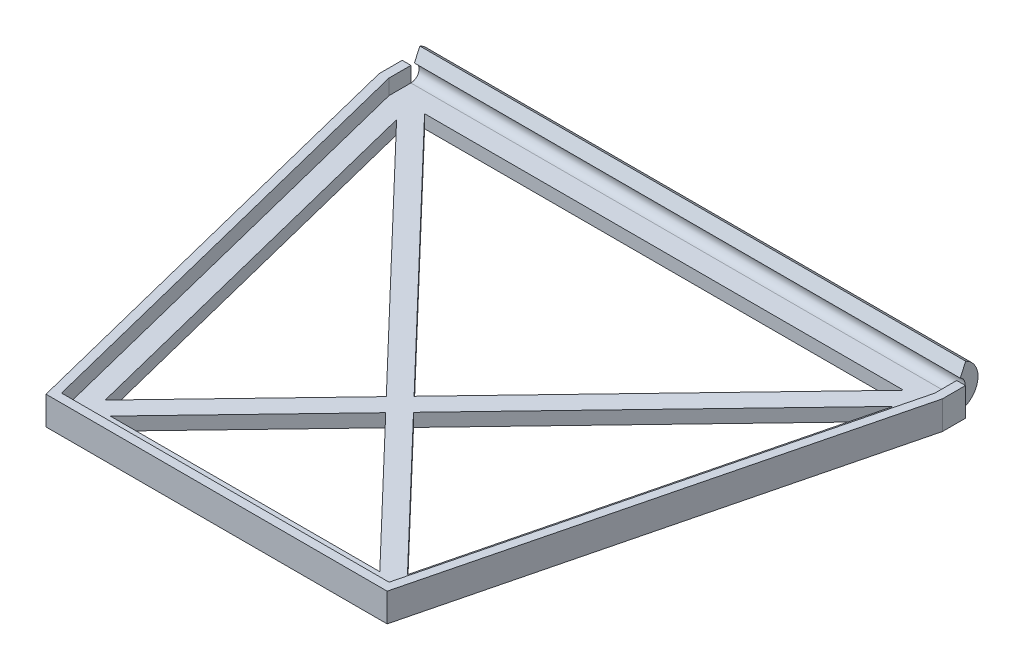
ISO-10303-21;
HEADER;
FILE_DESCRIPTION(('STEP AP214'),'2;1');
FILE_NAME('part.step','',(''),(''),'','','');
FILE_SCHEMA(('AUTOMOTIVE_DESIGN { 1 0 10303 214 1 1 1 1 }'));
ENDSEC;
DATA;
#1=APPLICATION_CONTEXT('core data for automotive mechanical design processes');
#2=APPLICATION_PROTOCOL_DEFINITION('international standard','automotive_design',2000,#1);
#3=PRODUCT_CONTEXT('',#1,'mechanical');
#4=PRODUCT('Part','Part','',(#3));
#5=PRODUCT_RELATED_PRODUCT_CATEGORY('part','',(#4));
#6=PRODUCT_DEFINITION_FORMATION('','',#4);
#7=PRODUCT_DEFINITION_CONTEXT('part definition',#1,'design');
#8=PRODUCT_DEFINITION('design','',#6,#7);
#9=PRODUCT_DEFINITION_SHAPE('','',#8);
#10=(LENGTH_UNIT() NAMED_UNIT(*) SI_UNIT(.MILLI.,.METRE.));
#11=(NAMED_UNIT(*) PLANE_ANGLE_UNIT() SI_UNIT($,.RADIAN.));
#12=(NAMED_UNIT(*) SI_UNIT($,.STERADIAN.) SOLID_ANGLE_UNIT());
#13=UNCERTAINTY_MEASURE_WITH_UNIT(LENGTH_MEASURE(1.E-05),#10,'distance_accuracy_value','');
#14=(GEOMETRIC_REPRESENTATION_CONTEXT(3) GLOBAL_UNCERTAINTY_ASSIGNED_CONTEXT((#13)) GLOBAL_UNIT_ASSIGNED_CONTEXT((#10,
#11,#12)) REPRESENTATION_CONTEXT('',''));
#15=CARTESIAN_POINT('',(0.,0.,0.));
#16=DIRECTION('',(0.,0.,1.));
#17=DIRECTION('',(1.,0.,0.));
#18=AXIS2_PLACEMENT_3D('',#15,#16,#17);
#19=CARTESIAN_POINT('',(25.01,1.2,-40.));
#20=DIRECTION('',(-1.,0.,0.));
#21=DIRECTION('',(0.,0.,1.));
#22=AXIS2_PLACEMENT_3D('',#19,#20,#21);
#23=PLANE('',#22);
#24=DIRECTION('',(0.,-1.,0.));
#25=VECTOR('',#24,1.);
#26=CARTESIAN_POINT('',(25.01,71.0684486178114,-42.01));
#27=LINE('',#26,#25);
#28=CARTESIAN_POINT('',(25.01,1.2,-42.01));
#29=VERTEX_POINT('',#28);
#30=CARTESIAN_POINT('',(25.01,0.,-42.01));
#31=VERTEX_POINT('',#30);
#32=EDGE_CURVE('E359',#29,#31,#27,.T.);
#33=ORIENTED_EDGE('',*,*,#32,.T.);
#34=CARTESIAN_POINT('',(25.01,1.95,-42.01));
#35=DIRECTION('',(-1.,0.,0.));
#36=DIRECTION('',(0.,0.,1.));
#37=AXIS2_PLACEMENT_3D('',#34,#35,#36);
#38=CIRCLE('',#37,1.95);
#39=CARTESIAN_POINT('',(25.01,3.71730018472147,-42.8341056103944));
#40=VERTEX_POINT('',#39);
#41=EDGE_CURVE('E376',#31,#40,#38,.F.);
#42=ORIENTED_EDGE('',*,*,#41,.T.);
#43=DIRECTION('',(0.,-0.906307787036654,0.42261826174069));
#44=VECTOR('',#43,1.);
#45=CARTESIAN_POINT('',(25.01,2.62973084027748,-42.3269636963055));
#46=LINE('',#45,#44);
#47=CARTESIAN_POINT('',(25.01,2.62973084027749,-42.3269636963055));
#48=VERTEX_POINT('',#47);
#49=EDGE_CURVE('E383',#40,#48,#46,.T.);
#50=ORIENTED_EDGE('',*,*,#49,.T.);
#51=CARTESIAN_POINT('',(25.01,1.95,-42.01));
#52=DIRECTION('',(-1.,0.,0.));
#53=DIRECTION('',(0.,0.,1.));
#54=AXIS2_PLACEMENT_3D('',#51,#52,#53);
#55=CIRCLE('',#54,0.75);
#56=EDGE_CURVE('E379',#48,#29,#55,.T.);
#57=ORIENTED_EDGE('',*,*,#56,.T.);
#58=EDGE_LOOP('',(#33,#42,#50,#57));
#59=FACE_BOUND('',#58,.T.);
#60=ADVANCED_FACE('F95',(#59),#23,.F.);
#61=CARTESIAN_POINT('',(-25.01,1.2,-42.));
#62=DIRECTION('',(1.,0.,0.));
#63=DIRECTION('',(0.,0.,-1.));
#64=AXIS2_PLACEMENT_3D('',#61,#62,#63);
#65=PLANE('',#64);
#66=DIRECTION('',(0.,-1.,0.));
#67=VECTOR('',#66,1.);
#68=CARTESIAN_POINT('',(-25.01,71.0684486178114,-42.01));
#69=LINE('',#68,#67);
#70=CARTESIAN_POINT('',(-25.01,1.2,-42.01));
#71=VERTEX_POINT('',#70);
#72=CARTESIAN_POINT('',(-25.01,0.,-42.01));
#73=VERTEX_POINT('',#72);
#74=EDGE_CURVE('E282',#71,#73,#69,.T.);
#75=ORIENTED_EDGE('',*,*,#74,.F.);
#76=CARTESIAN_POINT('',(-25.01,1.95,-42.01));
#77=DIRECTION('',(1.,0.,0.));
#78=DIRECTION('',(0.,0.,-1.));
#79=AXIS2_PLACEMENT_3D('',#76,#77,#78);
#80=CIRCLE('',#79,0.75);
#81=CARTESIAN_POINT('',(-25.01,2.62973084027749,-42.3269636963055));
#82=VERTEX_POINT('',#81);
#83=EDGE_CURVE('E293',#71,#82,#80,.T.);
#84=ORIENTED_EDGE('',*,*,#83,.T.);
#85=DIRECTION('',(0.,0.906307787036654,-0.42261826174069));
#86=VECTOR('',#85,1.);
#87=CARTESIAN_POINT('',(-25.01,2.62973084027749,-42.3269636963055));
#88=LINE('',#87,#86);
#89=CARTESIAN_POINT('',(-25.01,3.71730018472147,-42.8341056103944));
#90=VERTEX_POINT('',#89);
#91=EDGE_CURVE('E387',#82,#90,#88,.T.);
#92=ORIENTED_EDGE('',*,*,#91,.T.);
#93=CARTESIAN_POINT('',(-25.01,1.95,-42.01));
#94=DIRECTION('',(-1.,0.,0.));
#95=DIRECTION('',(0.,0.,-1.));
#96=AXIS2_PLACEMENT_3D('',#93,#94,#95);
#97=CIRCLE('',#96,1.95);
#98=EDGE_CURVE('E391',#90,#73,#97,.T.);
#99=ORIENTED_EDGE('',*,*,#98,.T.);
#100=EDGE_LOOP('',(#75,#84,#92,#99));
#101=FACE_BOUND('',#100,.T.);
#102=ADVANCED_FACE('F596',(#101),#65,.F.);
#103=CARTESIAN_POINT('',(-23.2537434997384,1.2,-40.4365641250654));
#104=DIRECTION('',(0.970142500145332,0.,-0.242535625036333));
#105=DIRECTION('',(-0.242535625036333,0.,-0.970142500145332));
#106=AXIS2_PLACEMENT_3D('',#103,#104,#105);
#107=PLANE('',#106);
#108=DIRECTION('',(0.242535625036333,0.,0.970142500145332));
#109=VECTOR('',#108,1.);
#110=CARTESIAN_POINT('',(-23.2537434997384,1.2,-40.4365641250654));
#111=LINE('',#110,#109);
#112=CARTESIAN_POINT('',(-22.7545280310404,1.2,-38.4397022502735));
#113=VERTEX_POINT('',#112);
#114=CARTESIAN_POINT('',(-13.8525347629165,1.2,-2.83172917777767));
#115=VERTEX_POINT('',#114);
#116=EDGE_CURVE('E109',#113,#115,#111,.T.);
#117=ORIENTED_EDGE('',*,*,#116,.T.);
#118=DIRECTION('',(0.,-1.,0.));
#119=VECTOR('',#118,1.);
#120=CARTESIAN_POINT('',(-13.8525347629165,1.2,-2.83172917777769));
#121=LINE('',#120,#119);
#122=CARTESIAN_POINT('',(-13.8525347629165,0.,-2.83172917777767));
#123=VERTEX_POINT('',#122);
#124=EDGE_CURVE('E13',#115,#123,#121,.T.);
#125=ORIENTED_EDGE('',*,*,#124,.T.);
#126=DIRECTION('',(0.242535625036333,0.,0.970142500145332));
#127=VECTOR('',#126,1.);
#128=CARTESIAN_POINT('',(-23.2537434997384,0.,-40.4365641250654));
#129=LINE('',#128,#127);
#130=CARTESIAN_POINT('',(-22.7545280310404,0.,-38.4397022502735));
#131=VERTEX_POINT('',#130);
#132=EDGE_CURVE('E448',#131,#123,#129,.T.);
#133=ORIENTED_EDGE('',*,*,#132,.F.);
#134=DIRECTION('',(0.,1.,0.));
#135=VECTOR('',#134,1.);
#136=CARTESIAN_POINT('',(-22.7545280310404,1.2,-38.4397022502735));
#137=LINE('',#136,#135);
#138=EDGE_CURVE('E103',#131,#113,#137,.T.);
#139=ORIENTED_EDGE('',*,*,#138,.T.);
#140=EDGE_LOOP('',(#117,#125,#133,#139));
#141=FACE_BOUND('',#140,.T.);
#142=ADVANCED_FACE('F601',(#141),#107,.T.);
#143=CARTESIAN_POINT('',(-15.,1.2,-1.8));
#144=DIRECTION('',(0.,0.,-1.));
#145=DIRECTION('',(-1.,0.,0.));
#146=AXIS2_PLACEMENT_3D('',#143,#144,#145);
#147=PLANE('',#146);
#148=DIRECTION('',(0.,-1.,0.));
#149=VECTOR('',#148,1.);
#150=CARTESIAN_POINT('',(-12.3482197531764,1.2,-1.8));
#151=LINE('',#150,#149);
#152=CARTESIAN_POINT('',(-12.3482197531764,1.2,-1.8));
#153=VERTEX_POINT('',#152);
#154=CARTESIAN_POINT('',(-12.3482197531764,0.,-1.8));
#155=VERTEX_POINT('',#154);
#156=EDGE_CURVE('E520',#153,#155,#151,.T.);
#157=ORIENTED_EDGE('',*,*,#156,.F.);
#158=DIRECTION('',(1.,0.,0.));
#159=VECTOR('',#158,1.);
#160=CARTESIAN_POINT('',(-15.,1.2,-1.8));
#161=LINE('',#160,#159);
#162=CARTESIAN_POINT('',(12.3482197531764,1.2,-1.8));
#163=VERTEX_POINT('',#162);
#164=EDGE_CURVE('E454',#153,#163,#161,.T.);
#165=ORIENTED_EDGE('',*,*,#164,.T.);
#166=DIRECTION('',(0.,-1.,0.));
#167=VECTOR('',#166,1.);
#168=CARTESIAN_POINT('',(12.3482197531764,1.2,-1.8));
#169=LINE('',#168,#167);
#170=CARTESIAN_POINT('',(12.3482197531764,0.,-1.8));
#171=VERTEX_POINT('',#170);
#172=EDGE_CURVE('E517',#163,#171,#169,.T.);
#173=ORIENTED_EDGE('',*,*,#172,.T.);
#174=DIRECTION('',(1.,0.,0.));
#175=VECTOR('',#174,1.);
#176=CARTESIAN_POINT('',(-15.,0.,-1.8));
#177=LINE('',#176,#175);
#178=EDGE_CURVE('E468',#155,#171,#177,.T.);
#179=ORIENTED_EDGE('',*,*,#178,.F.);
#180=EDGE_LOOP('',(#157,#165,#173,#179));
#181=FACE_BOUND('',#180,.T.);
#182=ADVANCED_FACE('F705',(#181),#147,.T.);
#183=CARTESIAN_POINT('',(25.,1.2,-40.2));
#184=DIRECTION('',(0.,0.,1.));
#185=DIRECTION('',(1.,0.,0.));
#186=AXIS2_PLACEMENT_3D('',#183,#184,#185);
#187=PLANE('',#186);
#188=DIRECTION('',(-1.,0.,0.));
#189=VECTOR('',#188,1.);
#190=CARTESIAN_POINT('',(25.,0.,-40.2));
#191=LINE('',#190,#189);
#192=CARTESIAN_POINT('',(21.9482197531764,0.,-40.2));
#193=VERTEX_POINT('',#192);
#194=CARTESIAN_POINT('',(-21.9482197531764,0.,-40.2));
#195=VERTEX_POINT('',#194);
#196=EDGE_CURVE('E455',#193,#195,#191,.T.);
#197=ORIENTED_EDGE('',*,*,#196,.F.);
#198=DIRECTION('',(0.,1.,0.));
#199=VECTOR('',#198,1.);
#200=CARTESIAN_POINT('',(21.9482197531764,1.2,-40.2));
#201=LINE('',#200,#199);
#202=CARTESIAN_POINT('',(21.9482197531764,1.2,-40.2));
#203=VERTEX_POINT('',#202);
#204=EDGE_CURVE('E505',#193,#203,#201,.T.);
#205=ORIENTED_EDGE('',*,*,#204,.T.);
#206=DIRECTION('',(-1.,0.,0.));
#207=VECTOR('',#206,1.);
#208=CARTESIAN_POINT('',(25.,1.2,-40.2));
#209=LINE('',#208,#207);
#210=CARTESIAN_POINT('',(-21.9482197531764,1.2,-40.2));
#211=VERTEX_POINT('',#210);
#212=EDGE_CURVE('E461',#203,#211,#209,.T.);
#213=ORIENTED_EDGE('',*,*,#212,.T.);
#214=DIRECTION('',(0.,1.,0.));
#215=VECTOR('',#214,1.);
#216=CARTESIAN_POINT('',(-21.9482197531764,1.2,-40.2));
#217=LINE('',#216,#215);
#218=EDGE_CURVE('E498',#195,#211,#217,.T.);
#219=ORIENTED_EDGE('',*,*,#218,.F.);
#220=EDGE_LOOP('',(#197,#205,#213,#219));
#221=FACE_BOUND('',#220,.T.);
#222=ADVANCED_FACE('F569',(#221),#187,.T.);
#223=CARTESIAN_POINT('',(0.,1.2,0.));
#224=DIRECTION('',(0.,1.,0.));
#225=DIRECTION('',(0.,0.,1.));
#226=AXIS2_PLACEMENT_3D('',#223,#224,#225);
#227=PLANE('',#226);
#228=ORIENTED_EDGE('',*,*,#164,.F.);
#229=DIRECTION('',(-0.69179954128703,0.,0.722089602940698));
#230=VECTOR('',#229,1.);
#231=CARTESIAN_POINT('',(23.8444831111187,1.2,-39.5773804128417));
#232=LINE('',#231,#230);
#233=CARTESIAN_POINT('',(0.,1.2,-14.6888797497715));
#234=VERTEX_POINT('',#233);
#235=EDGE_CURVE('E435',#234,#153,#232,.T.);
#236=ORIENTED_EDGE('',*,*,#235,.F.);
#237=DIRECTION('',(0.69179954128703,0.,0.722089602940698));
#238=VECTOR('',#237,1.);
#239=CARTESIAN_POINT('',(-23.8444831111187,1.2,-39.5773804128417));
#240=LINE('',#239,#238);
#241=EDGE_CURVE('E411',#234,#163,#240,.T.);
#242=ORIENTED_EDGE('',*,*,#241,.T.);
#243=EDGE_LOOP('',(#228,#236,#242));
#244=FACE_BOUND('',#243,.T.);
#245=DIRECTION('',(-0.69179954128703,0.,0.722089602940698));
#246=VECTOR('',#245,1.);
#247=CARTESIAN_POINT('',(22.5447218258254,1.2,-40.8226195871583));
#248=LINE('',#247,#246);
#249=CARTESIAN_POINT('',(-1.24638271529567,1.2,-15.9898346453553));
#250=VERTEX_POINT('',#249);
#251=EDGE_CURVE('E444',#250,#115,#248,.T.);
#252=ORIENTED_EDGE('',*,*,#251,.T.);
#253=ORIENTED_EDGE('',*,*,#116,.F.);
#254=EDGE_CURVE('E412',#113,#250,#240,.T.);
#255=ORIENTED_EDGE('',*,*,#254,.T.);
#256=EDGE_LOOP('',(#252,#253,#255));
#257=FACE_BOUND('',#256,.T.);
#258=CARTESIAN_POINT('',(22.7545280310405,1.2,-38.4397022502736));
#259=VERTEX_POINT('',#258);
#260=CARTESIAN_POINT('',(1.24638271529567,1.2,-15.9898346453553));
#261=VERTEX_POINT('',#260);
#262=EDGE_CURVE('E449',#259,#261,#232,.T.);
#263=ORIENTED_EDGE('',*,*,#262,.F.);
#264=DIRECTION('',(0.242535625036333,0.,-0.970142500145332));
#265=VECTOR('',#264,1.);
#266=CARTESIAN_POINT('',(13.2537434997384,1.2,-0.436564125065405));
#267=LINE('',#266,#265);
#268=CARTESIAN_POINT('',(13.8525347629165,1.2,-2.83172917777768));
#269=VERTEX_POINT('',#268);
#270=EDGE_CURVE('E458',#269,#259,#267,.T.);
#271=ORIENTED_EDGE('',*,*,#270,.F.);
#272=DIRECTION('',(0.69179954128703,0.,0.722089602940698));
#273=VECTOR('',#272,1.);
#274=CARTESIAN_POINT('',(-22.5447218258254,1.2,-40.8226195871583));
#275=LINE('',#274,#273);
#276=EDGE_CURVE('E401',#261,#269,#275,.T.);
#277=ORIENTED_EDGE('',*,*,#276,.F.);
#278=EDGE_LOOP('',(#263,#271,#277));
#279=FACE_BOUND('',#278,.T.);
#280=ORIENTED_EDGE('',*,*,#212,.F.);
#281=CARTESIAN_POINT('',(0.,1.2,-17.2907895409391));
#282=VERTEX_POINT('',#281);
#283=EDGE_CURVE('E445',#203,#282,#248,.T.);
#284=ORIENTED_EDGE('',*,*,#283,.T.);
#285=EDGE_CURVE('E416',#211,#282,#275,.T.);
#286=ORIENTED_EDGE('',*,*,#285,.F.);
#287=EDGE_LOOP('',(#280,#284,#286));
#288=FACE_BOUND('',#287,.T.);
#289=DIRECTION('',(0.242535625036333,0.,0.970142500145332));
#290=VECTOR('',#289,1.);
#291=CARTESIAN_POINT('',(-25.0097014250015,1.2,-39.9975746437496));
#292=LINE('',#291,#290);
#293=CARTESIAN_POINT('',(-25.01,1.2,-39.9987689437438));
#294=VERTEX_POINT('',#293);
#295=CARTESIAN_POINT('',(-15.007807764064,1.2,0.01));
#296=VERTEX_POINT('',#295);
#297=EDGE_CURVE('E479',#294,#296,#292,.T.);
#298=ORIENTED_EDGE('',*,*,#297,.T.);
#299=DIRECTION('',(1.,0.,0.));
#300=VECTOR('',#299,1.);
#301=CARTESIAN_POINT('',(-15.,1.2,0.01));
#302=LINE('',#301,#300);
#303=CARTESIAN_POINT('',(15.007807764064,1.2,0.00999999999999463));
#304=VERTEX_POINT('',#303);
#305=EDGE_CURVE('E482',#296,#304,#302,.T.);
#306=ORIENTED_EDGE('',*,*,#305,.T.);
#307=DIRECTION('',(0.242535625036333,0.,-0.970142500145332));
#308=VECTOR('',#307,1.);
#309=CARTESIAN_POINT('',(15.0097014250015,1.2,0.00242535625035796));
#310=LINE('',#309,#308);
#311=CARTESIAN_POINT('',(25.01,1.2,-39.9987689437438));
#312=VERTEX_POINT('',#311);
#313=EDGE_CURVE('E485',#304,#312,#310,.T.);
#314=ORIENTED_EDGE('',*,*,#313,.T.);
#315=DIRECTION('',(0.,0.,-1.));
#316=VECTOR('',#315,1.);
#317=CARTESIAN_POINT('',(25.01,1.2,-40.));
#318=LINE('',#317,#316);
#319=EDGE_CURVE('E488',#312,#29,#318,.T.);
#320=ORIENTED_EDGE('',*,*,#319,.T.);
#321=DIRECTION('',(-1.,0.,0.));
#322=VECTOR('',#321,1.);
#323=CARTESIAN_POINT('',(25.,1.2,-42.01));
#324=LINE('',#323,#322);
#325=EDGE_CURVE('E492',#29,#71,#324,.T.);
#326=ORIENTED_EDGE('',*,*,#325,.T.);
#327=DIRECTION('',(0.,0.,1.));
#328=VECTOR('',#327,1.);
#329=CARTESIAN_POINT('',(-25.01,1.2,-42.));
#330=LINE('',#329,#328);
#331=EDGE_CURVE('E277',#71,#294,#330,.T.);
#332=ORIENTED_EDGE('',*,*,#331,.T.);
#333=EDGE_LOOP('',(#298,#306,#314,#320,#326,#332));
#334=FACE_BOUND('',#333,.T.);
#335=ADVANCED_FACE('F548',(#244,#257,#279,#288,#334),#227,.T.);
#336=CARTESIAN_POINT('',(0.,0.,0.));
#337=DIRECTION('',(0.,1.,0.));
#338=DIRECTION('',(0.,0.,1.));
#339=AXIS2_PLACEMENT_3D('',#336,#337,#338);
#340=PLANE('',#339);
#341=DIRECTION('',(-1.,0.,0.));
#342=VECTOR('',#341,1.);
#343=CARTESIAN_POINT('',(25.,0.,-42.01));
#344=LINE('',#343,#342);
#345=EDGE_CURVE('E464',#31,#73,#344,.T.);
#346=ORIENTED_EDGE('',*,*,#345,.F.);
#347=DIRECTION('',(-1.,0.,0.));
#348=VECTOR('',#347,1.);
#349=CARTESIAN_POINT('',(25.81,0.,-42.01));
#350=LINE('',#349,#348);
#351=CARTESIAN_POINT('',(25.81,0.,-42.01));
#352=VERTEX_POINT('',#351);
#353=EDGE_CURVE('E353',#352,#31,#350,.T.);
#354=ORIENTED_EDGE('',*,*,#353,.F.);
#355=DIRECTION('',(0.,0.,1.));
#356=VECTOR('',#355,1.);
#357=CARTESIAN_POINT('',(25.81,0.,-42.01));
#358=LINE('',#357,#356);
#359=CARTESIAN_POINT('',(25.81,0.,-39.9002844432497));
#360=VERTEX_POINT('',#359);
#361=EDGE_CURVE('E628',#352,#360,#358,.T.);
#362=ORIENTED_EDGE('',*,*,#361,.T.);
#363=DIRECTION('',(-0.242535625036333,0.,0.970142500145332));
#364=VECTOR('',#363,1.);
#365=CARTESIAN_POINT('',(25.7861140001163,0.,-39.8047404437148));
#366=LINE('',#365,#364);
#367=CARTESIAN_POINT('',(15.6324288891876,0.,0.809999999999993));
#368=VERTEX_POINT('',#367);
#369=EDGE_CURVE('E635',#360,#368,#366,.T.);
#370=ORIENTED_EDGE('',*,*,#369,.T.);
#371=DIRECTION('',(-1.,0.,0.));
#372=VECTOR('',#371,1.);
#373=CARTESIAN_POINT('',(15.007807764064,0.,0.809999999999995));
#374=LINE('',#373,#372);
#375=CARTESIAN_POINT('',(-15.6324288891876,0.,0.809999999999999));
#376=VERTEX_POINT('',#375);
#377=EDGE_CURVE('E638',#368,#376,#374,.T.);
#378=ORIENTED_EDGE('',*,*,#377,.T.);
#379=DIRECTION('',(-0.242535625036333,0.,-0.970142500145332));
#380=VECTOR('',#379,1.);
#381=CARTESIAN_POINT('',(-15.7839217641803,0.,0.204028500029067));
#382=LINE('',#381,#380);
#383=CARTESIAN_POINT('',(-25.81,0.,-39.9002844432497));
#384=VERTEX_POINT('',#383);
#385=EDGE_CURVE('E322',#376,#384,#382,.T.);
#386=ORIENTED_EDGE('',*,*,#385,.T.);
#387=DIRECTION('',(0.,0.,1.));
#388=VECTOR('',#387,1.);
#389=CARTESIAN_POINT('',(-25.81,0.,-39.9987689437438));
#390=LINE('',#389,#388);
#391=CARTESIAN_POINT('',(-25.81,0.,-42.01));
#392=VERTEX_POINT('',#391);
#393=EDGE_CURVE('E305',#384,#392,#390,.F.);
#394=ORIENTED_EDGE('',*,*,#393,.T.);
#395=DIRECTION('',(-1.,0.,0.));
#396=VECTOR('',#395,1.);
#397=CARTESIAN_POINT('',(-25.01,0.,-42.01));
#398=LINE('',#397,#396);
#399=EDGE_CURVE('E281',#73,#392,#398,.T.);
#400=ORIENTED_EDGE('',*,*,#399,.F.);
#401=EDGE_LOOP('',(#346,#354,#362,#370,#378,#386,#394,#400));
#402=FACE_BOUND('',#401,.T.);
#403=DIRECTION('',(-0.69179954128703,0.,0.722089602940698));
#404=VECTOR('',#403,1.);
#405=CARTESIAN_POINT('',(23.8444831111187,0.,-39.5773804128417));
#406=LINE('',#405,#404);
#407=CARTESIAN_POINT('',(0.,0.,-14.6888797497715));
#408=VERTEX_POINT('',#407);
#409=EDGE_CURVE('E439',#408,#155,#406,.T.);
#410=ORIENTED_EDGE('',*,*,#409,.T.);
#411=ORIENTED_EDGE('',*,*,#178,.T.);
#412=DIRECTION('',(0.69179954128703,0.,0.722089602940698));
#413=VECTOR('',#412,1.);
#414=CARTESIAN_POINT('',(-23.8444831111187,0.,-39.5773804128417));
#415=LINE('',#414,#413);
#416=EDGE_CURVE('E406',#408,#171,#415,.T.);
#417=ORIENTED_EDGE('',*,*,#416,.F.);
#418=EDGE_LOOP('',(#410,#411,#417));
#419=FACE_BOUND('',#418,.T.);
#420=ORIENTED_EDGE('',*,*,#132,.T.);
#421=DIRECTION('',(-0.69179954128703,0.,0.722089602940698));
#422=VECTOR('',#421,1.);
#423=CARTESIAN_POINT('',(22.5447218258254,0.,-40.8226195871583));
#424=LINE('',#423,#422);
#425=CARTESIAN_POINT('',(-1.24638271529567,0.,-15.9898346453553));
#426=VERTEX_POINT('',#425);
#427=EDGE_CURVE('E440',#426,#123,#424,.T.);
#428=ORIENTED_EDGE('',*,*,#427,.F.);
#429=EDGE_CURVE('E402',#131,#426,#415,.T.);
#430=ORIENTED_EDGE('',*,*,#429,.F.);
#431=EDGE_LOOP('',(#420,#428,#430));
#432=FACE_BOUND('',#431,.T.);
#433=DIRECTION('',(0.242535625036333,0.,-0.970142500145332));
#434=VECTOR('',#433,1.);
#435=CARTESIAN_POINT('',(13.2537434997384,0.,-0.436564125065405));
#436=LINE('',#435,#434);
#437=CARTESIAN_POINT('',(13.8525347629165,0.,-2.83172917777767));
#438=VERTEX_POINT('',#437);
#439=CARTESIAN_POINT('',(22.7545280310405,0.,-38.4397022502736));
#440=VERTEX_POINT('',#439);
#441=EDGE_CURVE('E472',#438,#440,#436,.T.);
#442=ORIENTED_EDGE('',*,*,#441,.T.);
#443=CARTESIAN_POINT('',(1.24638271529567,0.,-15.9898346453553));
#444=VERTEX_POINT('',#443);
#445=EDGE_CURVE('E441',#440,#444,#406,.T.);
#446=ORIENTED_EDGE('',*,*,#445,.T.);
#447=DIRECTION('',(0.69179954128703,0.,0.722089602940698));
#448=VECTOR('',#447,1.);
#449=CARTESIAN_POINT('',(-22.5447218258254,0.,-40.8226195871583));
#450=LINE('',#449,#448);
#451=EDGE_CURVE('E405',#444,#438,#450,.T.);
#452=ORIENTED_EDGE('',*,*,#451,.T.);
#453=EDGE_LOOP('',(#442,#446,#452));
#454=FACE_BOUND('',#453,.T.);
#455=CARTESIAN_POINT('',(0.,0.,-17.2907895409391));
#456=VERTEX_POINT('',#455);
#457=EDGE_CURVE('E436',#193,#456,#424,.T.);
#458=ORIENTED_EDGE('',*,*,#457,.F.);
#459=ORIENTED_EDGE('',*,*,#196,.T.);
#460=EDGE_CURVE('E407',#195,#456,#450,.T.);
#461=ORIENTED_EDGE('',*,*,#460,.T.);
#462=EDGE_LOOP('',(#458,#459,#461));
#463=FACE_BOUND('',#462,.T.);
#464=ADVANCED_FACE('F556',(#402,#419,#432,#454,#463),#340,.F.);
#465=CARTESIAN_POINT('',(13.2537434997384,1.2,-0.436564125065405));
#466=DIRECTION('',(-0.970142500145332,0.,-0.242535625036333));
#467=DIRECTION('',(-0.242535625036333,0.,0.970142500145332));
#468=AXIS2_PLACEMENT_3D('',#465,#466,#467);
#469=PLANE('',#468);
#470=DIRECTION('',(0.,1.,0.));
#471=VECTOR('',#470,1.);
#472=CARTESIAN_POINT('',(22.7545280310404,1.2,-38.4397022502736));
#473=LINE('',#472,#471);
#474=EDGE_CURVE('E513',#440,#259,#473,.T.);
#475=ORIENTED_EDGE('',*,*,#474,.F.);
#476=ORIENTED_EDGE('',*,*,#441,.F.);
#477=DIRECTION('',(0.,-1.,0.));
#478=VECTOR('',#477,1.);
#479=CARTESIAN_POINT('',(13.8525347629165,1.2,-2.83172917777767));
#480=LINE('',#479,#478);
#481=EDGE_CURVE('E509',#269,#438,#480,.T.);
#482=ORIENTED_EDGE('',*,*,#481,.F.);
#483=ORIENTED_EDGE('',*,*,#270,.T.);
#484=EDGE_LOOP('',(#475,#476,#482,#483));
#485=FACE_BOUND('',#484,.T.);
#486=ADVANCED_FACE('F551',(#485),#469,.T.);
#487=CARTESIAN_POINT('',(23.8444831111187,56.1773984203283,-39.5773804128417));
#488=DIRECTION('',(0.722089602940698,0.,0.69179954128703));
#489=DIRECTION('',(0.69179954128703,0.,-0.722089602940698));
#490=AXIS2_PLACEMENT_3D('',#487,#488,#489);
#491=PLANE('',#490);
#492=ORIENTED_EDGE('',*,*,#235,.T.);
#493=ORIENTED_EDGE('',*,*,#156,.T.);
#494=ORIENTED_EDGE('',*,*,#409,.F.);
#495=DIRECTION('',(0.,1.,0.));
#496=VECTOR('',#495,1.);
#497=CARTESIAN_POINT('',(0.,56.1773984203283,-14.6888797497715));
#498=LINE('',#497,#496);
#499=EDGE_CURVE('E423',#408,#234,#498,.T.);
#500=ORIENTED_EDGE('',*,*,#499,.T.);
#501=EDGE_LOOP('',(#492,#493,#494,#500));
#502=FACE_BOUND('',#501,.T.);
#503=ADVANCED_FACE('F702',(#502),#491,.T.);
#504=CARTESIAN_POINT('',(22.5447218258254,56.1773984203283,-40.8226195871583));
#505=DIRECTION('',(0.722089602940698,0.,0.69179954128703));
#506=DIRECTION('',(0.69179954128703,0.,-0.722089602940698));
#507=AXIS2_PLACEMENT_3D('',#504,#505,#506);
#508=PLANE('',#507);
#509=ORIENTED_EDGE('',*,*,#124,.F.);
#510=ORIENTED_EDGE('',*,*,#251,.F.);
#511=DIRECTION('',(0.,1.,0.));
#512=VECTOR('',#511,1.);
#513=CARTESIAN_POINT('',(-1.24638271529568,56.1773984203283,-15.9898346453553));
#514=LINE('',#513,#512);
#515=EDGE_CURVE('E415',#426,#250,#514,.T.);
#516=ORIENTED_EDGE('',*,*,#515,.F.);
#517=ORIENTED_EDGE('',*,*,#427,.T.);
#518=EDGE_LOOP('',(#509,#510,#516,#517));
#519=FACE_BOUND('',#518,.T.);
#520=ADVANCED_FACE('F699',(#519),#508,.F.);
#521=ORIENTED_EDGE('',*,*,#445,.F.);
#522=ORIENTED_EDGE('',*,*,#474,.T.);
#523=ORIENTED_EDGE('',*,*,#262,.T.);
#524=DIRECTION('',(0.,1.,0.));
#525=VECTOR('',#524,1.);
#526=CARTESIAN_POINT('',(1.24638271529566,56.1773984203283,-15.9898346453553));
#527=LINE('',#526,#525);
#528=EDGE_CURVE('E431',#444,#261,#527,.T.);
#529=ORIENTED_EDGE('',*,*,#528,.F.);
#530=EDGE_LOOP('',(#521,#522,#523,#529));
#531=FACE_BOUND('',#530,.T.);
#532=ADVANCED_FACE('F554',(#531),#491,.T.);
#533=ORIENTED_EDGE('',*,*,#204,.F.);
#534=ORIENTED_EDGE('',*,*,#457,.T.);
#535=DIRECTION('',(0.,1.,0.));
#536=VECTOR('',#535,1.);
#537=CARTESIAN_POINT('',(0.,56.1773984203283,-17.2907895409391));
#538=LINE('',#537,#536);
#539=EDGE_CURVE('E427',#456,#282,#538,.T.);
#540=ORIENTED_EDGE('',*,*,#539,.T.);
#541=ORIENTED_EDGE('',*,*,#283,.F.);
#542=EDGE_LOOP('',(#533,#534,#540,#541));
#543=FACE_BOUND('',#542,.T.);
#544=ADVANCED_FACE('F566',(#543),#508,.F.);
#545=CARTESIAN_POINT('',(-23.8444831111187,56.1773984203283,-39.5773804128417));
#546=DIRECTION('',(0.722089602940698,0.,-0.69179954128703));
#547=DIRECTION('',(-0.69179954128703,0.,-0.722089602940698));
#548=AXIS2_PLACEMENT_3D('',#545,#546,#547);
#549=PLANE('',#548);
#550=ORIENTED_EDGE('',*,*,#138,.F.);
#551=ORIENTED_EDGE('',*,*,#429,.T.);
#552=ORIENTED_EDGE('',*,*,#515,.T.);
#553=ORIENTED_EDGE('',*,*,#254,.F.);
#554=EDGE_LOOP('',(#550,#551,#552,#553));
#555=FACE_BOUND('',#554,.T.);
#556=ADVANCED_FACE('F694',(#555),#549,.F.);
#557=CARTESIAN_POINT('',(-22.5447218258254,56.1773984203283,-40.8226195871583));
#558=DIRECTION('',(0.722089602940698,0.,-0.69179954128703));
#559=DIRECTION('',(-0.69179954128703,0.,-0.722089602940698));
#560=AXIS2_PLACEMENT_3D('',#557,#558,#559);
#561=PLANE('',#560);
#562=ORIENTED_EDGE('',*,*,#460,.F.);
#563=ORIENTED_EDGE('',*,*,#218,.T.);
#564=ORIENTED_EDGE('',*,*,#285,.T.);
#565=ORIENTED_EDGE('',*,*,#539,.F.);
#566=EDGE_LOOP('',(#562,#563,#564,#565));
#567=FACE_BOUND('',#566,.T.);
#568=ADVANCED_FACE('F572',(#567),#561,.T.);
#569=ORIENTED_EDGE('',*,*,#276,.T.);
#570=ORIENTED_EDGE('',*,*,#481,.T.);
#571=ORIENTED_EDGE('',*,*,#451,.F.);
#572=ORIENTED_EDGE('',*,*,#528,.T.);
#573=EDGE_LOOP('',(#569,#570,#571,#572));
#574=FACE_BOUND('',#573,.T.);
#575=ADVANCED_FACE('F542',(#574),#561,.T.);
#576=ORIENTED_EDGE('',*,*,#172,.F.);
#577=ORIENTED_EDGE('',*,*,#241,.F.);
#578=ORIENTED_EDGE('',*,*,#499,.F.);
#579=ORIENTED_EDGE('',*,*,#416,.T.);
#580=EDGE_LOOP('',(#576,#577,#578,#579));
#581=FACE_BOUND('',#580,.T.);
#582=ADVANCED_FACE('F690',(#581),#549,.F.);
#583=CARTESIAN_POINT('',(29.2077161246719,1.95,-42.01));
#584=DIRECTION('',(-1.,0.,0.));
#585=DIRECTION('',(0.,0.,1.));
#586=AXIS2_PLACEMENT_3D('',#583,#584,#585);
#587=CYLINDRICAL_SURFACE('',#586,0.75);
#588=ORIENTED_EDGE('',*,*,#56,.F.);
#589=DIRECTION('',(-1.,0.,0.));
#590=VECTOR('',#589,1.);
#591=CARTESIAN_POINT('',(29.2077161246719,2.62973084027749,-42.3269636963055));
#592=LINE('',#591,#590);
#593=EDGE_CURVE('E394',#48,#82,#592,.T.);
#594=ORIENTED_EDGE('',*,*,#593,.T.);
#595=ORIENTED_EDGE('',*,*,#83,.F.);
#596=ORIENTED_EDGE('',*,*,#325,.F.);
#597=EDGE_LOOP('',(#588,#594,#595,#596));
#598=FACE_BOUND('',#597,.T.);
#599=ADVANCED_FACE('F672',(#598),#587,.F.);
#600=CARTESIAN_POINT('',(29.2077161246719,1.95,-42.01));
#601=DIRECTION('',(-1.,0.,0.));
#602=DIRECTION('',(0.,0.,1.));
#603=AXIS2_PLACEMENT_3D('',#600,#601,#602);
#604=CYLINDRICAL_SURFACE('',#603,1.95);
#605=ORIENTED_EDGE('',*,*,#41,.F.);
#606=ORIENTED_EDGE('',*,*,#345,.T.);
#607=ORIENTED_EDGE('',*,*,#98,.F.);
#608=DIRECTION('',(-1.,0.,0.));
#609=VECTOR('',#608,1.);
#610=CARTESIAN_POINT('',(29.2077161246719,3.71730018472147,-42.8341056103944));
#611=LINE('',#610,#609);
#612=EDGE_CURVE('E380',#40,#90,#611,.T.);
#613=ORIENTED_EDGE('',*,*,#612,.F.);
#614=EDGE_LOOP('',(#605,#606,#607,#613));
#615=FACE_BOUND('',#614,.T.);
#616=ADVANCED_FACE('F614',(#615),#604,.T.);
#617=CARTESIAN_POINT('',(29.2077161246719,2.62973084027749,-42.3269636963055));
#618=DIRECTION('',(0.,0.42261826174069,0.906307787036654));
#619=DIRECTION('',(0.,-0.906307787036654,0.42261826174069));
#620=AXIS2_PLACEMENT_3D('',#617,#618,#619);
#621=PLANE('',#620);
#622=ORIENTED_EDGE('',*,*,#49,.F.);
#623=ORIENTED_EDGE('',*,*,#612,.T.);
#624=ORIENTED_EDGE('',*,*,#91,.F.);
#625=ORIENTED_EDGE('',*,*,#593,.F.);
#626=EDGE_LOOP('',(#622,#623,#624,#625));
#627=FACE_BOUND('',#626,.T.);
#628=ADVANCED_FACE('F677',(#627),#621,.T.);
#629=CARTESIAN_POINT('',(-25.81,71.0684486178114,-39.9987689437438));
#630=DIRECTION('',(-1.,0.,0.));
#631=DIRECTION('',(0.,0.,1.));
#632=AXIS2_PLACEMENT_3D('',#629,#630,#631);
#633=PLANE('',#632);
#634=DIRECTION('',(0.,-1.,0.));
#635=VECTOR('',#634,1.);
#636=CARTESIAN_POINT('',(-25.81,71.0684486178114,-39.9002844432497));
#637=LINE('',#636,#635);
#638=CARTESIAN_POINT('',(-25.81,2.6,-39.9002844432497));
#639=VERTEX_POINT('',#638);
#640=EDGE_CURVE('E335',#639,#384,#637,.T.);
#641=ORIENTED_EDGE('',*,*,#640,.F.);
#642=DIRECTION('',(0.,0.,-1.));
#643=VECTOR('',#642,1.);
#644=CARTESIAN_POINT('',(-25.81,2.6,-39.9987689437438));
#645=LINE('',#644,#643);
#646=CARTESIAN_POINT('',(-25.81,2.6,-42.01));
#647=VERTEX_POINT('',#646);
#648=EDGE_CURVE('E339',#639,#647,#645,.T.);
#649=ORIENTED_EDGE('',*,*,#648,.T.);
#650=DIRECTION('',(0.,-1.,0.));
#651=VECTOR('',#650,1.);
#652=CARTESIAN_POINT('',(-25.81,71.0684486178114,-42.01));
#653=LINE('',#652,#651);
#654=EDGE_CURVE('E288',#647,#392,#653,.T.);
#655=ORIENTED_EDGE('',*,*,#654,.T.);
#656=ORIENTED_EDGE('',*,*,#393,.F.);
#657=EDGE_LOOP('',(#641,#649,#655,#656));
#658=FACE_BOUND('',#657,.T.);
#659=ADVANCED_FACE('F653',(#658),#633,.T.);
#660=CARTESIAN_POINT('',(-15.7839217641803,71.0684486178114,0.204028500029067));
#661=DIRECTION('',(-0.970142500145332,0.,0.242535625036333));
#662=DIRECTION('',(0.242535625036333,0.,0.970142500145332));
#663=AXIS2_PLACEMENT_3D('',#660,#661,#662);
#664=PLANE('',#663);
#665=DIRECTION('',(0.,-1.,0.));
#666=VECTOR('',#665,1.);
#667=CARTESIAN_POINT('',(-15.6324288891876,71.0684486178114,0.809999999999999));
#668=LINE('',#667,#666);
#669=CARTESIAN_POINT('',(-15.6324288891876,2.6,0.809999999999999));
#670=VERTEX_POINT('',#669);
#671=EDGE_CURVE('E331',#670,#376,#668,.T.);
#672=ORIENTED_EDGE('',*,*,#671,.F.);
#673=DIRECTION('',(-0.242535625036333,0.,-0.970142500145332));
#674=VECTOR('',#673,1.);
#675=CARTESIAN_POINT('',(-15.7839217641803,2.6,0.204028500029067));
#676=LINE('',#675,#674);
#677=EDGE_CURVE('E336',#670,#639,#676,.T.);
#678=ORIENTED_EDGE('',*,*,#677,.T.);
#679=ORIENTED_EDGE('',*,*,#640,.T.);
#680=ORIENTED_EDGE('',*,*,#385,.F.);
#681=EDGE_LOOP('',(#672,#678,#679,#680));
#682=FACE_BOUND('',#681,.T.);
#683=ADVANCED_FACE('F649',(#682),#664,.T.);
#684=CARTESIAN_POINT('',(15.007807764064,71.0684486178114,0.809999999999995));
#685=DIRECTION('',(0.,0.,1.));
#686=DIRECTION('',(1.,0.,0.));
#687=AXIS2_PLACEMENT_3D('',#684,#685,#686);
#688=PLANE('',#687);
#689=DIRECTION('',(0.,-1.,0.));
#690=VECTOR('',#689,1.);
#691=CARTESIAN_POINT('',(15.6324288891876,71.0684486178114,0.809999999999993));
#692=LINE('',#691,#690);
#693=CARTESIAN_POINT('',(15.6324288891876,2.6,0.809999999999993));
#694=VERTEX_POINT('',#693);
#695=EDGE_CURVE('E327',#694,#368,#692,.T.);
#696=ORIENTED_EDGE('',*,*,#695,.F.);
#697=DIRECTION('',(-1.,0.,0.));
#698=VECTOR('',#697,1.);
#699=CARTESIAN_POINT('',(15.007807764064,2.6,0.809999999999995));
#700=LINE('',#699,#698);
#701=EDGE_CURVE('E332',#694,#670,#700,.T.);
#702=ORIENTED_EDGE('',*,*,#701,.T.);
#703=ORIENTED_EDGE('',*,*,#671,.T.);
#704=ORIENTED_EDGE('',*,*,#377,.F.);
#705=EDGE_LOOP('',(#696,#702,#703,#704));
#706=FACE_BOUND('',#705,.T.);
#707=ADVANCED_FACE('F659',(#706),#688,.T.);
#708=CARTESIAN_POINT('',(25.7861140001163,71.0684486178114,-39.8047404437148));
#709=DIRECTION('',(0.970142500145332,0.,0.242535625036333));
#710=DIRECTION('',(0.242535625036333,0.,-0.970142500145332));
#711=AXIS2_PLACEMENT_3D('',#708,#709,#710);
#712=PLANE('',#711);
#713=DIRECTION('',(0.,-1.,0.));
#714=VECTOR('',#713,1.);
#715=CARTESIAN_POINT('',(25.81,71.0684486178114,-39.9002844432497));
#716=LINE('',#715,#714);
#717=CARTESIAN_POINT('',(25.81,2.6,-39.9002844432497));
#718=VERTEX_POINT('',#717);
#719=EDGE_CURVE('E326',#718,#360,#716,.T.);
#720=ORIENTED_EDGE('',*,*,#719,.F.);
#721=DIRECTION('',(-0.242535625036333,0.,0.970142500145332));
#722=VECTOR('',#721,1.);
#723=CARTESIAN_POINT('',(25.7861140001163,2.6,-39.8047404437148));
#724=LINE('',#723,#722);
#725=EDGE_CURVE('E328',#718,#694,#724,.T.);
#726=ORIENTED_EDGE('',*,*,#725,.T.);
#727=ORIENTED_EDGE('',*,*,#695,.T.);
#728=ORIENTED_EDGE('',*,*,#369,.F.);
#729=EDGE_LOOP('',(#720,#726,#727,#728));
#730=FACE_BOUND('',#729,.T.);
#731=ADVANCED_FACE('F662',(#730),#712,.T.);
#732=CARTESIAN_POINT('',(25.81,71.0684486178114,-42.01));
#733=DIRECTION('',(1.,0.,0.));
#734=DIRECTION('',(0.,0.,-1.));
#735=AXIS2_PLACEMENT_3D('',#732,#733,#734);
#736=PLANE('',#735);
#737=DIRECTION('',(0.,-1.,0.));
#738=VECTOR('',#737,1.);
#739=CARTESIAN_POINT('',(25.81,71.0684486178114,-42.01));
#740=LINE('',#739,#738);
#741=CARTESIAN_POINT('',(25.81,2.6,-42.01));
#742=VERTEX_POINT('',#741);
#743=EDGE_CURVE('E350',#742,#352,#740,.T.);
#744=ORIENTED_EDGE('',*,*,#743,.F.);
#745=DIRECTION('',(0.,0.,1.));
#746=VECTOR('',#745,1.);
#747=CARTESIAN_POINT('',(25.81,2.6,-42.01));
#748=LINE('',#747,#746);
#749=EDGE_CURVE('E323',#742,#718,#748,.T.);
#750=ORIENTED_EDGE('',*,*,#749,.T.);
#751=ORIENTED_EDGE('',*,*,#719,.T.);
#752=ORIENTED_EDGE('',*,*,#361,.F.);
#753=EDGE_LOOP('',(#744,#750,#751,#752));
#754=FACE_BOUND('',#753,.T.);
#755=ADVANCED_FACE('F664',(#754),#736,.T.);
#756=CARTESIAN_POINT('',(25.81,71.0684486178114,-42.01));
#757=DIRECTION('',(0.,0.,1.));
#758=DIRECTION('',(1.,0.,0.));
#759=AXIS2_PLACEMENT_3D('',#756,#757,#758);
#760=PLANE('',#759);
#761=DIRECTION('',(-1.,0.,0.));
#762=VECTOR('',#761,1.);
#763=CARTESIAN_POINT('',(25.81,2.6,-42.01));
#764=LINE('',#763,#762);
#765=CARTESIAN_POINT('',(25.01,2.6,-42.01));
#766=VERTEX_POINT('',#765);
#767=EDGE_CURVE('E318',#742,#766,#764,.T.);
#768=ORIENTED_EDGE('',*,*,#767,.F.);
#769=ORIENTED_EDGE('',*,*,#743,.T.);
#770=ORIENTED_EDGE('',*,*,#353,.T.);
#771=ORIENTED_EDGE('',*,*,#32,.F.);
#772=EDGE_CURVE('E354',#766,#29,#27,.T.);
#773=ORIENTED_EDGE('',*,*,#772,.F.);
#774=EDGE_LOOP('',(#768,#769,#770,#771,#773));
#775=FACE_BOUND('',#774,.T.);
#776=ADVANCED_FACE('F623',(#775),#760,.F.);
#777=CARTESIAN_POINT('',(25.01,71.0684486178114,-42.01));
#778=DIRECTION('',(1.,0.,0.));
#779=DIRECTION('',(0.,0.,-1.));
#780=AXIS2_PLACEMENT_3D('',#777,#778,#779);
#781=PLANE('',#780);
#782=ORIENTED_EDGE('',*,*,#319,.F.);
#783=DIRECTION('',(0.,-1.,0.));
#784=VECTOR('',#783,1.);
#785=CARTESIAN_POINT('',(25.01,71.0684486178114,-39.9987689437438));
#786=LINE('',#785,#784);
#787=CARTESIAN_POINT('',(25.01,2.6,-39.9987689437438));
#788=VERTEX_POINT('',#787);
#789=EDGE_CURVE('E358',#788,#312,#786,.T.);
#790=ORIENTED_EDGE('',*,*,#789,.F.);
#791=DIRECTION('',(0.,0.,1.));
#792=VECTOR('',#791,1.);
#793=CARTESIAN_POINT('',(25.01,2.6,-42.01));
#794=LINE('',#793,#792);
#795=EDGE_CURVE('E314',#766,#788,#794,.T.);
#796=ORIENTED_EDGE('',*,*,#795,.F.);
#797=ORIENTED_EDGE('',*,*,#772,.T.);
#798=EDGE_LOOP('',(#782,#790,#796,#797));
#799=FACE_BOUND('',#798,.T.);
#800=ADVANCED_FACE('F667',(#799),#781,.F.);
#801=CARTESIAN_POINT('',(25.01,71.0684486178114,-39.9987689437438));
#802=DIRECTION('',(0.970142500145332,0.,0.242535625036333));
#803=DIRECTION('',(0.242535625036333,0.,-0.970142500145332));
#804=AXIS2_PLACEMENT_3D('',#801,#802,#803);
#805=PLANE('',#804);
#806=ORIENTED_EDGE('',*,*,#313,.F.);
#807=DIRECTION('',(0.,-1.,0.));
#808=VECTOR('',#807,1.);
#809=CARTESIAN_POINT('',(15.007807764064,71.0684486178114,0.00999999999999463));
#810=LINE('',#809,#808);
#811=CARTESIAN_POINT('',(15.007807764064,2.6,0.00999999999999463));
#812=VERTEX_POINT('',#811);
#813=EDGE_CURVE('E363',#812,#304,#810,.T.);
#814=ORIENTED_EDGE('',*,*,#813,.F.);
#815=DIRECTION('',(-0.242535625036333,0.,0.970142500145332));
#816=VECTOR('',#815,1.);
#817=CARTESIAN_POINT('',(25.01,2.6,-39.9987689437438));
#818=LINE('',#817,#816);
#819=EDGE_CURVE('E310',#788,#812,#818,.T.);
#820=ORIENTED_EDGE('',*,*,#819,.F.);
#821=ORIENTED_EDGE('',*,*,#789,.T.);
#822=EDGE_LOOP('',(#806,#814,#820,#821));
#823=FACE_BOUND('',#822,.T.);
#824=ADVANCED_FACE('F593',(#823),#805,.F.);
#825=CARTESIAN_POINT('',(15.007807764064,71.0684486178114,0.00999999999999463));
#826=DIRECTION('',(0.,0.,1.));
#827=DIRECTION('',(1.,0.,0.));
#828=AXIS2_PLACEMENT_3D('',#825,#826,#827);
#829=PLANE('',#828);
#830=ORIENTED_EDGE('',*,*,#305,.F.);
#831=DIRECTION('',(0.,-1.,0.));
#832=VECTOR('',#831,1.);
#833=CARTESIAN_POINT('',(-15.007807764064,71.0684486178114,0.01));
#834=LINE('',#833,#832);
#835=CARTESIAN_POINT('',(-15.007807764064,2.6,0.01));
#836=VERTEX_POINT('',#835);
#837=EDGE_CURVE('E367',#836,#296,#834,.T.);
#838=ORIENTED_EDGE('',*,*,#837,.F.);
#839=DIRECTION('',(-1.,0.,0.));
#840=VECTOR('',#839,1.);
#841=CARTESIAN_POINT('',(15.007807764064,2.6,0.00999999999999463));
#842=LINE('',#841,#840);
#843=EDGE_CURVE('E302',#812,#836,#842,.T.);
#844=ORIENTED_EDGE('',*,*,#843,.F.);
#845=ORIENTED_EDGE('',*,*,#813,.T.);
#846=EDGE_LOOP('',(#830,#838,#844,#845));
#847=FACE_BOUND('',#846,.T.);
#848=ADVANCED_FACE('F583',(#847),#829,.F.);
#849=CARTESIAN_POINT('',(-15.007807764064,71.0684486178114,0.01));
#850=DIRECTION('',(-0.970142500145332,0.,0.242535625036333));
#851=DIRECTION('',(0.242535625036333,0.,0.970142500145332));
#852=AXIS2_PLACEMENT_3D('',#849,#850,#851);
#853=PLANE('',#852);
#854=ORIENTED_EDGE('',*,*,#297,.F.);
#855=DIRECTION('',(0.,-1.,0.));
#856=VECTOR('',#855,1.);
#857=CARTESIAN_POINT('',(-25.01,71.0684486178114,-39.9987689437438));
#858=LINE('',#857,#856);
#859=CARTESIAN_POINT('',(-25.01,2.6,-39.9987689437438));
#860=VERTEX_POINT('',#859);
#861=EDGE_CURVE('E371',#860,#294,#858,.T.);
#862=ORIENTED_EDGE('',*,*,#861,.F.);
#863=DIRECTION('',(-0.242535625036333,0.,-0.970142500145332));
#864=VECTOR('',#863,1.);
#865=CARTESIAN_POINT('',(-15.007807764064,2.6,0.01));
#866=LINE('',#865,#864);
#867=EDGE_CURVE('E298',#836,#860,#866,.T.);
#868=ORIENTED_EDGE('',*,*,#867,.F.);
#869=ORIENTED_EDGE('',*,*,#837,.T.);
#870=EDGE_LOOP('',(#854,#862,#868,#869));
#871=FACE_BOUND('',#870,.T.);
#872=ADVANCED_FACE('F585',(#871),#853,.F.);
#873=CARTESIAN_POINT('',(-25.01,71.0684486178114,-39.9987689437438));
#874=DIRECTION('',(-1.,0.,0.));
#875=DIRECTION('',(0.,0.,1.));
#876=AXIS2_PLACEMENT_3D('',#873,#874,#875);
#877=PLANE('',#876);
#878=ORIENTED_EDGE('',*,*,#331,.F.);
#879=CARTESIAN_POINT('',(-25.01,2.6,-42.01));
#880=VERTEX_POINT('',#879);
#881=EDGE_CURVE('E270',#880,#71,#69,.T.);
#882=ORIENTED_EDGE('',*,*,#881,.F.);
#883=DIRECTION('',(0.,0.,-1.));
#884=VECTOR('',#883,1.);
#885=CARTESIAN_POINT('',(-25.01,2.6,-39.9987689437438));
#886=LINE('',#885,#884);
#887=EDGE_CURVE('E275',#860,#880,#886,.T.);
#888=ORIENTED_EDGE('',*,*,#887,.F.);
#889=ORIENTED_EDGE('',*,*,#861,.T.);
#890=EDGE_LOOP('',(#878,#882,#888,#889));
#891=FACE_BOUND('',#890,.T.);
#892=ADVANCED_FACE('F272',(#891),#877,.F.);
#893=CARTESIAN_POINT('',(-25.01,71.0684486178114,-42.01));
#894=DIRECTION('',(0.,0.,1.));
#895=DIRECTION('',(1.,0.,0.));
#896=AXIS2_PLACEMENT_3D('',#893,#894,#895);
#897=PLANE('',#896);
#898=DIRECTION('',(-1.,0.,0.));
#899=VECTOR('',#898,1.);
#900=CARTESIAN_POINT('',(-25.01,2.6,-42.01));
#901=LINE('',#900,#899);
#902=EDGE_CURVE('E285',#880,#647,#901,.T.);
#903=ORIENTED_EDGE('',*,*,#902,.F.);
#904=ORIENTED_EDGE('',*,*,#881,.T.);
#905=ORIENTED_EDGE('',*,*,#74,.T.);
#906=ORIENTED_EDGE('',*,*,#399,.T.);
#907=ORIENTED_EDGE('',*,*,#654,.F.);
#908=EDGE_LOOP('',(#903,#904,#905,#906,#907));
#909=FACE_BOUND('',#908,.T.);
#910=ADVANCED_FACE('F286',(#909),#897,.F.);
#911=CARTESIAN_POINT('',(0.,2.6,0.));
#912=DIRECTION('',(0.,1.,0.));
#913=DIRECTION('',(0.,0.,1.));
#914=AXIS2_PLACEMENT_3D('',#911,#912,#913);
#915=PLANE('',#914);
#916=ORIENTED_EDGE('',*,*,#648,.F.);
#917=ORIENTED_EDGE('',*,*,#677,.F.);
#918=ORIENTED_EDGE('',*,*,#701,.F.);
#919=ORIENTED_EDGE('',*,*,#725,.F.);
#920=ORIENTED_EDGE('',*,*,#749,.F.);
#921=ORIENTED_EDGE('',*,*,#767,.T.);
#922=ORIENTED_EDGE('',*,*,#795,.T.);
#923=ORIENTED_EDGE('',*,*,#819,.T.);
#924=ORIENTED_EDGE('',*,*,#843,.T.);
#925=ORIENTED_EDGE('',*,*,#867,.T.);
#926=ORIENTED_EDGE('',*,*,#887,.T.);
#927=ORIENTED_EDGE('',*,*,#902,.T.);
#928=EDGE_LOOP('',(#916,#917,#918,#919,#920,#921,#922,#923,#924,#925,#926,#927));
#929=FACE_BOUND('',#928,.T.);
#930=ADVANCED_FACE('F296',(#929),#915,.T.);
#931=CLOSED_SHELL('',(#60,#102,#142,#182,#222,#335,#464,#486,#503,#520,#532,#544,#556,#568,#575,
#582,#599,#616,#628,#659,#683,#707,#731,#755,#776,#800,#824,#848,#872,#892,#910,#930));
#932=MANIFOLD_SOLID_BREP('B2',#931);
#933=ADVANCED_BREP_SHAPE_REPRESENTATION('',(#18,#932),#14);
#934=SHAPE_DEFINITION_REPRESENTATION(#9,#933);
ENDSEC;
END-ISO-10303-21;
